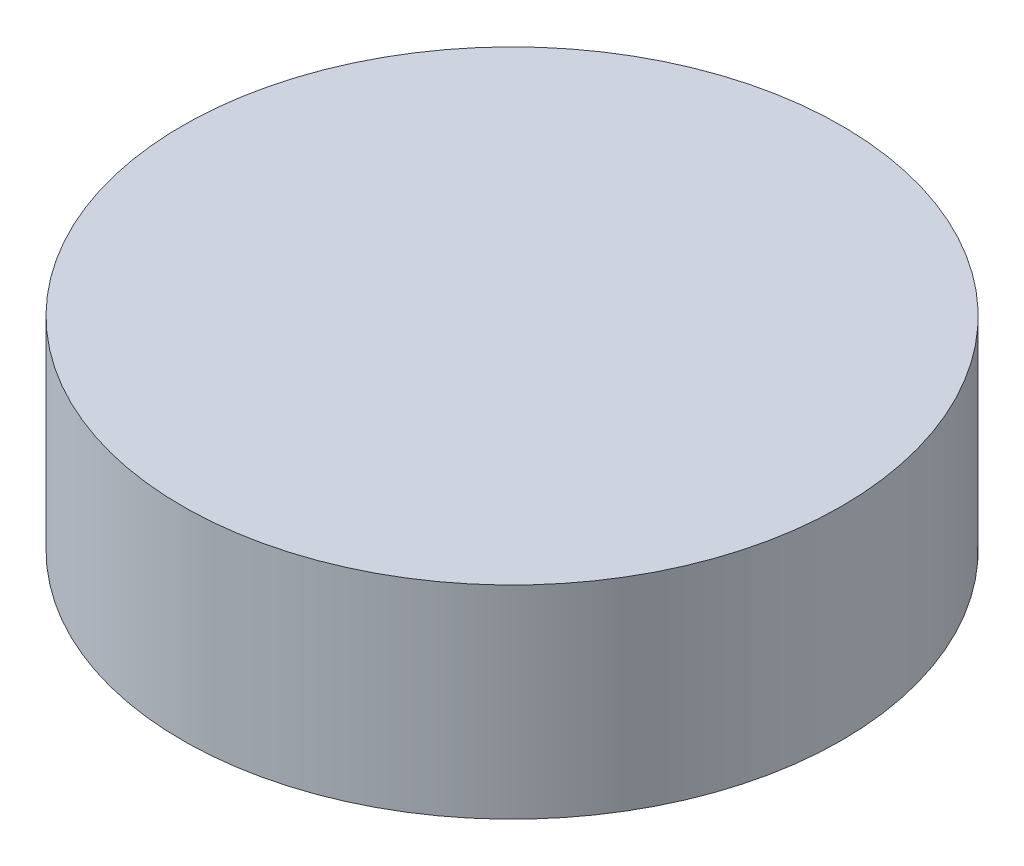
ISO-10303-21;
HEADER;
FILE_DESCRIPTION(('STEP AP214'),'2;1');
FILE_NAME('part.step','',(''),(''),'','','');
FILE_SCHEMA(('AUTOMOTIVE_DESIGN { 1 0 10303 214 1 1 1 1 }'));
ENDSEC;
DATA;
#1=APPLICATION_CONTEXT('core data for automotive mechanical design processes');
#2=APPLICATION_PROTOCOL_DEFINITION('international standard','automotive_design',2000,#1);
#3=PRODUCT_CONTEXT('',#1,'mechanical');
#4=PRODUCT('Part','Part','',(#3));
#5=PRODUCT_RELATED_PRODUCT_CATEGORY('part','',(#4));
#6=PRODUCT_DEFINITION_FORMATION('','',#4);
#7=PRODUCT_DEFINITION_CONTEXT('part definition',#1,'design');
#8=PRODUCT_DEFINITION('design','',#6,#7);
#9=PRODUCT_DEFINITION_SHAPE('','',#8);
#10=(LENGTH_UNIT() NAMED_UNIT(*) SI_UNIT(.MILLI.,.METRE.));
#11=(NAMED_UNIT(*) PLANE_ANGLE_UNIT() SI_UNIT($,.RADIAN.));
#12=(NAMED_UNIT(*) SI_UNIT($,.STERADIAN.) SOLID_ANGLE_UNIT());
#13=UNCERTAINTY_MEASURE_WITH_UNIT(LENGTH_MEASURE(1.E-05),#10,'distance_accuracy_value','');
#14=(GEOMETRIC_REPRESENTATION_CONTEXT(3) GLOBAL_UNCERTAINTY_ASSIGNED_CONTEXT((#13)) GLOBAL_UNIT_ASSIGNED_CONTEXT((#10,
#11,#12)) REPRESENTATION_CONTEXT('',''));
#15=CARTESIAN_POINT('',(0.,0.,0.));
#16=DIRECTION('',(0.,0.,1.));
#17=DIRECTION('',(1.,0.,0.));
#18=AXIS2_PLACEMENT_3D('',#15,#16,#17);
#19=CARTESIAN_POINT('',(0.,-10.16,0.));
#20=DIRECTION('',(0.,1.,0.));
#21=DIRECTION('',(-1.,0.,0.));
#22=AXIS2_PLACEMENT_3D('',#19,#20,#21);
#23=CYLINDRICAL_SURFACE('',#22,16.51);
#24=CARTESIAN_POINT('',(0.,-10.16,0.));
#25=DIRECTION('',(0.,-1.,0.));
#26=DIRECTION('',(1.,0.,0.));
#27=AXIS2_PLACEMENT_3D('',#24,#25,#26);
#28=CIRCLE('',#27,16.51);
#29=CARTESIAN_POINT('',(16.51,-10.16,0.));
#30=VERTEX_POINT('',#29);
#31=EDGE_CURVE('E10',#30,#30,#28,.T.);
#32=ORIENTED_EDGE('',*,*,#31,.F.);
#33=EDGE_LOOP('',(#32));
#34=FACE_BOUND('',#33,.T.);
#35=CARTESIAN_POINT('',(0.,0.,0.));
#36=DIRECTION('',(0.,-1.,0.));
#37=DIRECTION('',(1.,0.,0.));
#38=AXIS2_PLACEMENT_3D('',#35,#36,#37);
#39=CIRCLE('',#38,16.51);
#40=CARTESIAN_POINT('',(16.51,0.,0.));
#41=VERTEX_POINT('',#40);
#42=EDGE_CURVE('E35',#41,#41,#39,.T.);
#43=ORIENTED_EDGE('',*,*,#42,.T.);
#44=EDGE_LOOP('',(#43));
#45=FACE_BOUND('',#44,.T.);
#46=ADVANCED_FACE('F32',(#34,#45),#23,.T.);
#47=CARTESIAN_POINT('',(0.,-10.16,0.));
#48=DIRECTION('',(0.,-1.,0.));
#49=DIRECTION('',(1.,0.,0.));
#50=AXIS2_PLACEMENT_3D('',#47,#48,#49);
#51=PLANE('',#50);
#52=ORIENTED_EDGE('',*,*,#31,.T.);
#53=EDGE_LOOP('',(#52));
#54=FACE_BOUND('',#53,.T.);
#55=ADVANCED_FACE('F47',(#54),#51,.T.);
#56=CARTESIAN_POINT('',(0.,0.,0.));
#57=DIRECTION('',(0.,-1.,0.));
#58=DIRECTION('',(1.,0.,0.));
#59=AXIS2_PLACEMENT_3D('',#56,#57,#58);
#60=PLANE('',#59);
#61=ORIENTED_EDGE('',*,*,#42,.F.);
#62=EDGE_LOOP('',(#61));
#63=FACE_BOUND('',#62,.T.);
#64=ADVANCED_FACE('F45',(#63),#60,.F.);
#65=CLOSED_SHELL('',(#46,#55,#64));
#66=MANIFOLD_SOLID_BREP('B2',#65);
#67=ADVANCED_BREP_SHAPE_REPRESENTATION('',(#18,#66),#14);
#68=SHAPE_DEFINITION_REPRESENTATION(#9,#67);
ENDSEC;
END-ISO-10303-21;
